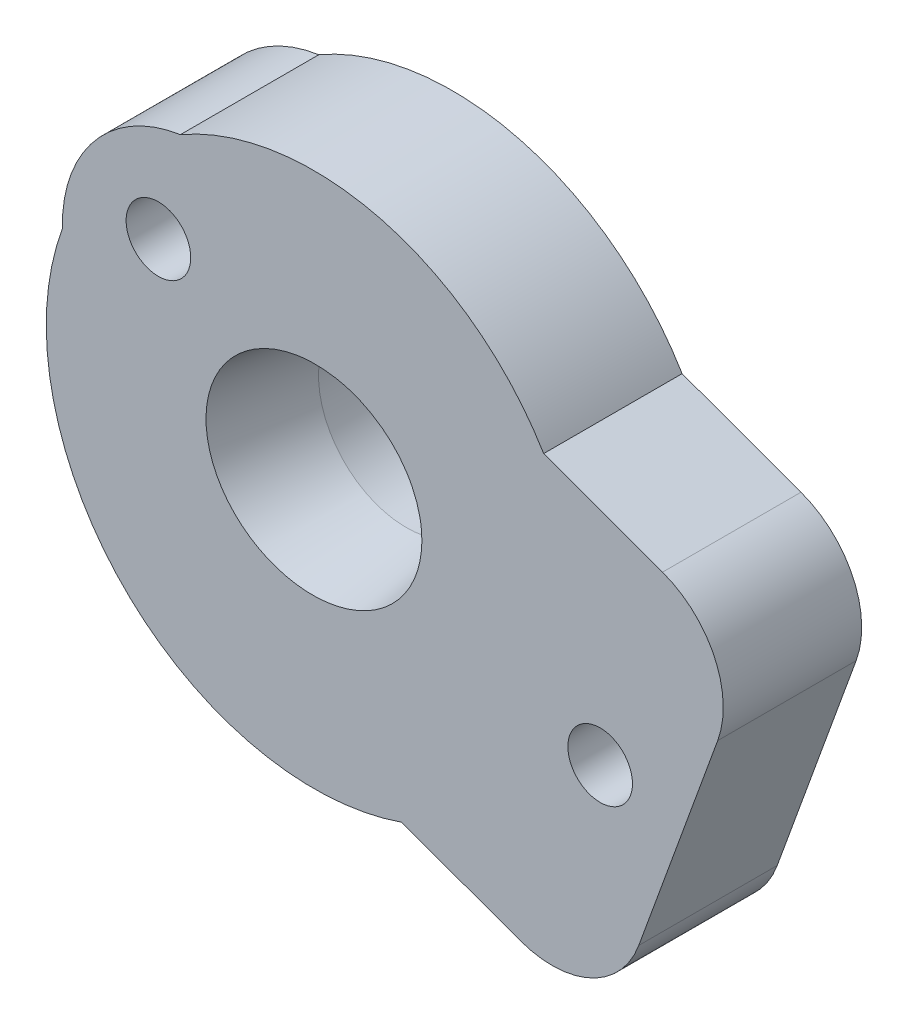
ISO-10303-21;
HEADER;
FILE_DESCRIPTION(('STEP AP214'),'2;1');
FILE_NAME('part.step','',(''),(''),'','','');
FILE_SCHEMA(('AUTOMOTIVE_DESIGN { 1 0 10303 214 1 1 1 1 }'));
ENDSEC;
DATA;
#1=APPLICATION_CONTEXT('core data for automotive mechanical design processes');
#2=APPLICATION_PROTOCOL_DEFINITION('international standard','automotive_design',2000,#1);
#3=PRODUCT_CONTEXT('',#1,'mechanical');
#4=PRODUCT('Part','Part','',(#3));
#5=PRODUCT_RELATED_PRODUCT_CATEGORY('part','',(#4));
#6=PRODUCT_DEFINITION_FORMATION('','',#4);
#7=PRODUCT_DEFINITION_CONTEXT('part definition',#1,'design');
#8=PRODUCT_DEFINITION('design','',#6,#7);
#9=PRODUCT_DEFINITION_SHAPE('','',#8);
#10=(LENGTH_UNIT() NAMED_UNIT(*) SI_UNIT(.MILLI.,.METRE.));
#11=(NAMED_UNIT(*) PLANE_ANGLE_UNIT() SI_UNIT($,.RADIAN.));
#12=(NAMED_UNIT(*) SI_UNIT($,.STERADIAN.) SOLID_ANGLE_UNIT());
#13=UNCERTAINTY_MEASURE_WITH_UNIT(LENGTH_MEASURE(1.E-05),#10,'distance_accuracy_value','');
#14=(GEOMETRIC_REPRESENTATION_CONTEXT(3) GLOBAL_UNCERTAINTY_ASSIGNED_CONTEXT((#13)) GLOBAL_UNIT_ASSIGNED_CONTEXT((#10,
#11,#12)) REPRESENTATION_CONTEXT('',''));
#15=CARTESIAN_POINT('',(0.,0.,0.));
#16=DIRECTION('',(0.,0.,1.));
#17=DIRECTION('',(1.,0.,0.));
#18=AXIS2_PLACEMENT_3D('',#15,#16,#17);
#19=CARTESIAN_POINT('',(0.,0.,10.));
#20=DIRECTION('',(0.,0.,-1.));
#21=DIRECTION('',(-1.,0.,0.));
#22=AXIS2_PLACEMENT_3D('',#19,#20,#21);
#23=CYLINDRICAL_SURFACE('',#22,29.);
#24=CARTESIAN_POINT('',(0.,0.,10.));
#25=DIRECTION('',(0.,0.,1.));
#26=DIRECTION('',(1.,0.,0.));
#27=AXIS2_PLACEMENT_3D('',#24,#25,#26);
#28=CIRCLE('',#27,29.);
#29=CARTESIAN_POINT('',(-27.2510860027963,9.91858415643088,10.));
#30=VERTEX_POINT('',#29);
#31=CARTESIAN_POINT('',(9.4973269071652,-27.4007441800115,10.));
#32=VERTEX_POINT('',#31);
#33=EDGE_CURVE('E156',#30,#32,#28,.T.);
#34=ORIENTED_EDGE('',*,*,#33,.F.);
#35=DIRECTION('',(0.,0.,1.));
#36=VECTOR('',#35,1.);
#37=CARTESIAN_POINT('',(-27.2510860027963,9.91858415643088,-5.));
#38=LINE('',#37,#36);
#39=CARTESIAN_POINT('',(-27.2510860027963,9.91858415643088,-5.));
#40=VERTEX_POINT('',#39);
#41=EDGE_CURVE('E214',#40,#30,#38,.T.);
#42=ORIENTED_EDGE('',*,*,#41,.F.);
#43=CARTESIAN_POINT('',(0.,0.,-5.));
#44=DIRECTION('',(0.,0.,1.));
#45=DIRECTION('',(1.,0.,0.));
#46=AXIS2_PLACEMENT_3D('',#43,#44,#45);
#47=CIRCLE('',#46,29.);
#48=CARTESIAN_POINT('',(9.4973269071652,-27.4007441800115,-5.));
#49=VERTEX_POINT('',#48);
#50=EDGE_CURVE('E225',#40,#49,#47,.T.);
#51=ORIENTED_EDGE('',*,*,#50,.T.);
#52=DIRECTION('',(0.,0.,-1.));
#53=VECTOR('',#52,1.);
#54=CARTESIAN_POINT('',(9.49732690716522,-27.4007441800115,10.));
#55=LINE('',#54,#53);
#56=EDGE_CURVE('E239',#49,#32,#55,.F.);
#57=ORIENTED_EDGE('',*,*,#56,.T.);
#58=EDGE_LOOP('',(#34,#42,#51,#57));
#59=FACE_BOUND('',#58,.T.);
#60=ADVANCED_FACE('F146',(#59),#23,.T.);
#61=CARTESIAN_POINT('',(24.88823335682,14.8854237553544,-5.));
#62=VERTEX_POINT('',#61);
#63=CARTESIAN_POINT('',(-14.4705437140708,25.1317202876995,-5.));
#64=VERTEX_POINT('',#63);
#65=EDGE_CURVE('E234',#62,#64,#47,.T.);
#66=ORIENTED_EDGE('',*,*,#65,.T.);
#67=DIRECTION('',(0.,0.,1.));
#68=VECTOR('',#67,1.);
#69=CARTESIAN_POINT('',(-14.4705437140708,25.1317202876995,-5.));
#70=LINE('',#69,#68);
#71=CARTESIAN_POINT('',(-14.4705437140708,25.1317202876995,10.));
#72=VERTEX_POINT('',#71);
#73=EDGE_CURVE('E217',#64,#72,#70,.T.);
#74=ORIENTED_EDGE('',*,*,#73,.T.);
#75=CARTESIAN_POINT('',(24.88823335682,14.8854237553545,10.));
#76=VERTEX_POINT('',#75);
#77=EDGE_CURVE('E13',#76,#72,#28,.T.);
#78=ORIENTED_EDGE('',*,*,#77,.F.);
#79=DIRECTION('',(0.,0.,-1.));
#80=VECTOR('',#79,1.);
#81=CARTESIAN_POINT('',(24.88823335682,14.8854237553544,10.));
#82=LINE('',#81,#80);
#83=EDGE_CURVE('E312',#62,#76,#82,.F.);
#84=ORIENTED_EDGE('',*,*,#83,.F.);
#85=EDGE_LOOP('',(#66,#74,#78,#84));
#86=FACE_BOUND('',#85,.T.);
#87=ADVANCED_FACE('F148',(#86),#23,.T.);
#88=CARTESIAN_POINT('',(0.,0.,10.));
#89=DIRECTION('',(0.,0.,1.));
#90=DIRECTION('',(1.,0.,0.));
#91=AXIS2_PLACEMENT_3D('',#88,#89,#90);
#92=PLANE('',#91);
#93=ORIENTED_EDGE('',*,*,#77,.T.);
#94=CARTESIAN_POINT('',(-12.2352670019781,10.2788370513048,10.));
#95=DIRECTION('',(0.,0.,1.));
#96=DIRECTION('',(1.,0.,0.));
#97=AXIS2_PLACEMENT_3D('',#94,#95,#96);
#98=CIRCLE('',#97,15.0201398932766);
#99=EDGE_CURVE('E163',#72,#30,#98,.T.);
#100=ORIENTED_EDGE('',*,*,#99,.T.);
#101=ORIENTED_EDGE('',*,*,#33,.T.);
#102=DIRECTION('',(-0.939692620785911,0.342020143325663,0.));
#103=VECTOR('',#102,1.);
#104=CARTESIAN_POINT('',(22.3747106403217,-32.0877285541042,10.));
#105=LINE('',#104,#103);
#106=CARTESIAN_POINT('',(22.3747106403217,-32.0877285541042,10.));
#107=VERTEX_POINT('',#106);
#108=EDGE_CURVE('E321',#107,#32,#105,.T.);
#109=ORIENTED_EDGE('',*,*,#108,.F.);
#110=CARTESIAN_POINT('',(25.7949120735784,-22.6908023462451,10.));
#111=DIRECTION('',(0.,0.,1.));
#112=DIRECTION('',(1.,0.,0.));
#113=AXIS2_PLACEMENT_3D('',#110,#111,#112);
#114=CIRCLE('',#113,10.);
#115=CARTESIAN_POINT('',(35.1918382814375,-26.1110037795017,10.));
#116=VERTEX_POINT('',#115);
#117=EDGE_CURVE('E324',#116,#107,#114,.F.);
#118=ORIENTED_EDGE('',*,*,#117,.F.);
#119=DIRECTION('',(0.342020143325663,0.939692620785911,0.));
#120=VECTOR('',#119,1.);
#121=CARTESIAN_POINT('',(35.1918382814375,-26.1110037795017,10.));
#122=LINE('',#121,#120);
#123=CARTESIAN_POINT('',(43.742341864579,-2.61868825985399,10.));
#124=VERTEX_POINT('',#123);
#125=EDGE_CURVE('E329',#116,#124,#122,.T.);
#126=ORIENTED_EDGE('',*,*,#125,.T.);
#127=CARTESIAN_POINT('',(34.3454156567199,0.80151317340266,10.));
#128=DIRECTION('',(0.,0.,1.));
#129=DIRECTION('',(1.,0.,0.));
#130=AXIS2_PLACEMENT_3D('',#127,#128,#129);
#131=CIRCLE('',#130,10.);
#132=CARTESIAN_POINT('',(37.7656170899766,10.1984393812618,10.));
#133=VERTEX_POINT('',#132);
#134=EDGE_CURVE('E315',#124,#133,#131,.T.);
#135=ORIENTED_EDGE('',*,*,#134,.T.);
#136=DIRECTION('',(-0.939692620785911,0.342020143325663,0.));
#137=VECTOR('',#136,1.);
#138=CARTESIAN_POINT('',(37.7656170899766,10.1984393812618,10.));
#139=LINE('',#138,#137);
#140=EDGE_CURVE('E169',#133,#76,#139,.T.);
#141=ORIENTED_EDGE('',*,*,#140,.T.);
#142=EDGE_LOOP('',(#93,#100,#101,#109,#118,#126,#135,#141));
#143=FACE_BOUND('',#142,.T.);
#144=CARTESIAN_POINT('',(-16.8529777486086,14.1413274131145,10.));
#145=DIRECTION('',(0.,0.,1.));
#146=DIRECTION('',(1.,0.,0.));
#147=AXIS2_PLACEMENT_3D('',#144,#145,#146);
#148=CIRCLE('',#147,3.5);
#149=CARTESIAN_POINT('',(-13.3529777486086,14.1413274131145,10.));
#150=VERTEX_POINT('',#149);
#151=EDGE_CURVE('E325',#150,#150,#148,.T.);
#152=ORIENTED_EDGE('',*,*,#151,.F.);
#153=EDGE_LOOP('',(#152));
#154=FACE_BOUND('',#153,.T.);
#155=CARTESIAN_POINT('',(0.,0.,10.));
#156=DIRECTION('',(0.,0.,1.));
#157=DIRECTION('',(0.996194698091745,0.0871557427476656,0.));
#158=AXIS2_PLACEMENT_3D('',#155,#156,#157);
#159=ELLIPSE('',#158,11.7,10.9);
#160=CARTESIAN_POINT('',(11.6554779676734,1.01972219014769,10.));
#161=VERTEX_POINT('',#160);
#162=EDGE_CURVE('E298',#161,#161,#159,.T.);
#163=ORIENTED_EDGE('',*,*,#162,.F.);
#164=EDGE_LOOP('',(#163));
#165=FACE_BOUND('',#164,.T.);
#166=CARTESIAN_POINT('',(31.009856485935,-11.2866647297469,10.));
#167=DIRECTION('',(0.,0.,1.));
#168=DIRECTION('',(1.,0.,0.));
#169=AXIS2_PLACEMENT_3D('',#166,#167,#168);
#170=CIRCLE('',#169,3.5);
#171=CARTESIAN_POINT('',(34.509856485935,-11.2866647297469,10.));
#172=VERTEX_POINT('',#171);
#173=EDGE_CURVE('E310',#172,#172,#170,.F.);
#174=ORIENTED_EDGE('',*,*,#173,.T.);
#175=EDGE_LOOP('',(#174));
#176=FACE_BOUND('',#175,.T.);
#177=ADVANCED_FACE('F275',(#143,#154,#165,#176),#92,.T.);
#178=CARTESIAN_POINT('',(0.82797955610265,-9.4638496318716,0.));
#179=CARTESIAN_POINT('',(0.848315896077142,-9.69629506142633,1.66666666666667));
#180=CARTESIAN_POINT('',(0.888988576026125,-10.1611859205358,5.));
#181=CARTESIAN_POINT('',(0.929661255975078,-10.6260767796453,8.33333333333334));
#182=CARTESIAN_POINT('',(0.949997595949554,-10.8585222092,10.));
#183=CARTESIAN_POINT('',(2.0667945661406,-9.35546736228754,0.));
#184=CARTESIAN_POINT('',(2.12792208834004,-9.58434402582576,1.66666666666667));
#185=CARTESIAN_POINT('',(2.25017713273893,-10.0420973529022,5.));
#186=CARTESIAN_POINT('',(2.36605710040764,-10.5004084269217,8.33333333333334));
#187=CARTESIAN_POINT('',(2.42399708424199,-10.7295639639314,10.));
#188=CARTESIAN_POINT('',(4.50089888047922,-8.64656557606986,0.));
#189=CARTESIAN_POINT('',(4.64350675930876,-8.86484387485121,1.66666666666666));
#190=CARTESIAN_POINT('',(4.92872251696785,-9.30140047241392,4.99999999999999));
#191=CARTESIAN_POINT('',(5.1939292748559,-9.73251379813695,8.33333333333334));
#192=CARTESIAN_POINT('',(5.32653265379993,-9.94807046099846,10.));
#193=CARTESIAN_POINT('',(7.46716345646486,-6.26550092433688,0.));
#194=CARTESIAN_POINT('',(7.73507009998541,-6.44343938202825,1.66666666666667));
#195=CARTESIAN_POINT('',(8.27088338702653,-6.79931629741098,5.00000000000002));
#196=CARTESIAN_POINT('',(8.7501401870744,-7.1369514054178,8.33333333333333));
#197=CARTESIAN_POINT('',(8.98976858709834,-7.30576895942121,9.99999999999998));
#198=CARTESIAN_POINT('',(9.29650319896245,-2.93123231543229,0.));
#199=CARTESIAN_POINT('',(9.66743128755973,-3.02182287384426,1.66666666666666));
#200=CARTESIAN_POINT('',(10.4092874647543,-3.20300399066821,4.99999999999999));
#201=CARTESIAN_POINT('',(11.0589275568529,-3.37289987928917,8.33333333333333));
#202=CARTESIAN_POINT('',(11.3837476029022,-3.45784782359964,10.));
#203=CARTESIAN_POINT('',(9.71057118739856,0.849564895258722,0.));
#204=CARTESIAN_POINT('',(10.1158578897645,0.885022887193555,1.66666666666667));
#205=CARTESIAN_POINT('',(10.9264312944965,0.95593887106322,5.00000000000001));
#206=CARTESIAN_POINT('',(11.6328464496746,1.01774218888427,8.33333333333334));
#207=CARTESIAN_POINT('',(11.9860540272637,1.0486438477948,10.));
#208=CARTESIAN_POINT('',(8.64626527634788,4.50102114929213,0.));
#209=CARTESIAN_POINT('',(8.9958272484264,4.65464642019637,1.66666666666666));
#210=CARTESIAN_POINT('',(9.69495119258344,4.96189696200486,4.99999999999999));
#211=CARTESIAN_POINT('',(10.3052196804976,5.24202056845598,8.33333333333333));
#212=CARTESIAN_POINT('',(10.6103539244546,5.38208237168153,10.));
#213=CARTESIAN_POINT('',(6.26572764725463,7.46697321334815,0.));
#214=CARTESIAN_POINT('',(6.49866549796217,7.68872988647386,1.66666666666667));
#215=CARTESIAN_POINT('',(6.96454119937725,8.13224323272529,5.00000000000002));
#216=CARTESIAN_POINT('',(7.37788729052637,8.54797097474241,8.33333333333332));
#217=CARTESIAN_POINT('',(7.58456033610093,8.75583484575096,9.99999999999997));
#218=CARTESIAN_POINT('',(2.93105975765796,9.29677770470038,0.));
#219=CARTESIAN_POINT('',(3.03359747356226,9.53650346393429,1.66666666666666));
#220=CARTESIAN_POINT('',(3.23867290537087,10.0159549824021,4.99999999999999));
#221=CARTESIAN_POINT('',(3.42498853331052,10.4865713982132,8.33333333333334));
#222=CARTESIAN_POINT('',(3.51814634728035,10.7218796061188,10.));
#223=CARTESIAN_POINT('',(0.410835453935297,9.57223190145566,0.));
#224=CARTESIAN_POINT('',(0.4312902961858,9.8082460970269,1.66666666666667));
#225=CARTESIAN_POINT('',(0.472199980686806,10.2802744881694,5.));
#226=CARTESIAN_POINT('',(0.506734588457658,10.7517451323689,8.33333333333334));
#227=CARTESIAN_POINT('',(0.524001892343083,10.9874804544686,10.));
#228=CARTESIAN_POINT('',(-2.06679456614061,9.35546736228753,0.));
#229=CARTESIAN_POINT('',(-2.12792208834001,9.58434402582577,1.66666666666667));
#230=CARTESIAN_POINT('',(-2.25017713273881,10.0420973529022,5.));
#231=CARTESIAN_POINT('',(-2.36605710040748,10.5004084269217,8.33333333333333));
#232=CARTESIAN_POINT('',(-2.42399708424181,10.7295639639314,10.));
#233=CARTESIAN_POINT('',(-4.50089888047922,8.64656557606986,0.));
#234=CARTESIAN_POINT('',(-4.64350675930873,8.86484387485123,1.66666666666667));
#235=CARTESIAN_POINT('',(-4.92872251696775,9.30140047241397,5.));
#236=CARTESIAN_POINT('',(-5.19392927485576,9.73251379813701,8.33333333333331));
#237=CARTESIAN_POINT('',(-5.32653265379977,9.94807046099852,9.99999999999997));
#238=CARTESIAN_POINT('',(-7.46716345646489,6.26550092433686,0.));
#239=CARTESIAN_POINT('',(-7.73507009998542,6.44343938202825,1.66666666666667));
#240=CARTESIAN_POINT('',(-8.27088338702649,6.79931629741101,5.00000000000001));
#241=CARTESIAN_POINT('',(-8.75014018707435,7.13695140541789,8.33333333333335));
#242=CARTESIAN_POINT('',(-8.98976858709828,7.30576895942132,10.));
#243=CARTESIAN_POINT('',(-9.29650319896246,2.93123231543228,0.));
#244=CARTESIAN_POINT('',(-9.66743128755973,3.02182287384428,1.66666666666667));
#245=CARTESIAN_POINT('',(-10.4092874647543,3.20300399066826,5.));
#246=CARTESIAN_POINT('',(-11.0589275568529,3.37289987928922,8.33333333333331));
#247=CARTESIAN_POINT('',(-11.3837476029022,3.45784782359969,9.99999999999997));
#248=CARTESIAN_POINT('',(-9.71057118739855,-0.849564895258744,0.));
#249=CARTESIAN_POINT('',(-10.1158578897645,-0.885022887193575,1.66666666666667));
#250=CARTESIAN_POINT('',(-10.9264312944965,-0.955938871063238,5.00000000000001));
#251=CARTESIAN_POINT('',(-11.6328464496746,-1.01774218888426,8.33333333333336));
#252=CARTESIAN_POINT('',(-11.9860540272637,-1.04864384779477,10.));
#253=CARTESIAN_POINT('',(-8.64626527634789,-4.50102114929208,0.));
#254=CARTESIAN_POINT('',(-8.99582724842641,-4.65464642019636,1.66666666666666));
#255=CARTESIAN_POINT('',(-9.69495119258344,-4.96189696200491,4.99999999999998));
#256=CARTESIAN_POINT('',(-10.3052196804975,-5.24202056845605,8.33333333333333));
#257=CARTESIAN_POINT('',(-10.6103539244546,-5.38208237168161,9.99999999999999));
#258=CARTESIAN_POINT('',(-6.26572764725465,-7.46697321334818,0.));
#259=CARTESIAN_POINT('',(-6.49866549796215,-7.68872988647389,1.66666666666667));
#260=CARTESIAN_POINT('',(-6.96454119937714,-8.13224323272532,5.00000000000002));
#261=CARTESIAN_POINT('',(-7.37788729052629,-8.54797097474247,8.33333333333334));
#262=CARTESIAN_POINT('',(-7.58456033610087,-8.75583484575104,9.99999999999999));
#263=CARTESIAN_POINT('',(-2.93105975765798,-9.29677770470035,0.));
#264=CARTESIAN_POINT('',(-3.03359747356226,-9.53650346393428,1.66666666666667));
#265=CARTESIAN_POINT('',(-3.23867290537083,-10.0159549824021,5.));
#266=CARTESIAN_POINT('',(-3.42498853331037,-10.4865713982133,8.33333333333333));
#267=CARTESIAN_POINT('',(-3.51814634728015,-10.7218796061188,10.));
#268=CARTESIAN_POINT('',(-0.410835453935306,-9.57223190145566,0.));
#269=CARTESIAN_POINT('',(-0.431290296185767,-9.8082460970269,1.66666666666667));
#270=CARTESIAN_POINT('',(-0.472199980686687,-10.2802744881694,5.));
#271=CARTESIAN_POINT('',(-0.506734588457493,-10.7517451323689,8.33333333333334));
#272=CARTESIAN_POINT('',(-0.524001892342896,-10.9874804544686,10.));
#273=CARTESIAN_POINT('',(0.82797955610265,-9.4638496318716,0.));
#274=CARTESIAN_POINT('',(0.848315896077142,-9.69629506142633,1.66666666666667));
#275=CARTESIAN_POINT('',(0.888988576026125,-10.1611859205358,5.));
#276=CARTESIAN_POINT('',(0.929661255975078,-10.6260767796453,8.33333333333334));
#277=CARTESIAN_POINT('',(0.949997595949554,-10.8585222092,10.));
#278=B_SPLINE_SURFACE_WITH_KNOTS('',3,3,((#178,#179,#180,#181,#182),(#183,#184,#185,#186,#187),
(#188,#189,#190,#191,#192),(#193,#194,#195,#196,#197),(#198,#199,#200,#201,#202),(#203,#204,
#205,#206,#207),(#208,#209,#210,#211,#212),(#213,#214,#215,#216,#217),(#218,#219,#220,#221,
#222),(#223,#224,#225,#226,#227),(#228,#229,#230,#231,#232),(#233,#234,#235,#236,#237),(#238,
#239,#240,#241,#242),(#243,#244,#245,#246,#247),(#248,#249,#250,#251,#252),(#253,#254,#255,#256,
#257),(#258,#259,#260,#261,#262),(#263,#264,#265,#266,#267),(#268,#269,#270,#271,#272),(#273,
#274,#275,#276,#277)),.UNSPECIFIED.,.T.,.F.,.F.,(4,1,1,1,1,1,1,1,2,1,1,1,1,1,1,1,4),(4,1,4),(0.,
0.0624999999999998,0.125,0.1875,0.249999999999999,0.312499999999999,0.374999999999999,
0.437499999999999,0.499999999999999,0.562499999999999,0.624999999999999,0.687499999999999,
0.749999999999999,0.8125,0.875,0.9375,1.),(0.,0.5,1.),.UNSPECIFIED.);
#279=CARTESIAN_POINT('',(0.,0.,0.));
#280=DIRECTION('',(0.,0.,1.));
#281=DIRECTION('',(0.996194698091745,0.0871557427476652,0.));
#282=AXIS2_PLACEMENT_3D('',#279,#280,#281);
#283=ELLIPSE('',#282,9.50000000000001,9.50000000000001);
#284=CARTESIAN_POINT('',(9.46384963187158,0.82797955610282,0.));
#285=VERTEX_POINT('',#284);
#286=EDGE_CURVE('E237',#285,#285,#283,.T.);
#287=ORIENTED_EDGE('',*,*,#286,.F.);
#288=EDGE_LOOP('',(#287));
#289=FACE_BOUND('',#288,.T.);
#290=ORIENTED_EDGE('',*,*,#162,.T.);
#291=EDGE_LOOP('',(#290));
#292=FACE_BOUND('',#291,.T.);
#293=ADVANCED_FACE('F269',(#289,#292),#278,.F.);
#294=CARTESIAN_POINT('',(0.,0.,-5.));
#295=DIRECTION('',(0.,0.,1.));
#296=DIRECTION('',(1.,0.,0.));
#297=AXIS2_PLACEMENT_3D('',#294,#295,#296);
#298=PLANE('',#297);
#299=CARTESIAN_POINT('',(-16.8529777486086,14.1413274131145,-5.));
#300=DIRECTION('',(0.,0.,-1.));
#301=DIRECTION('',(-1.,0.,0.));
#302=AXIS2_PLACEMENT_3D('',#299,#300,#301);
#303=CIRCLE('',#302,3.5);
#304=CARTESIAN_POINT('',(-20.3529777486086,14.1413274131145,-5.));
#305=VERTEX_POINT('',#304);
#306=EDGE_CURVE('E367',#305,#305,#303,.T.);
#307=ORIENTED_EDGE('',*,*,#306,.F.);
#308=EDGE_LOOP('',(#307));
#309=FACE_BOUND('',#308,.T.);
#310=ORIENTED_EDGE('',*,*,#50,.F.);
#311=CARTESIAN_POINT('',(-12.2352670019781,10.2788370513048,-5.));
#312=DIRECTION('',(0.,0.,1.));
#313=DIRECTION('',(1.,0.,0.));
#314=AXIS2_PLACEMENT_3D('',#311,#312,#313);
#315=CIRCLE('',#314,15.0201398932766);
#316=EDGE_CURVE('E211',#64,#40,#315,.T.);
#317=ORIENTED_EDGE('',*,*,#316,.F.);
#318=ORIENTED_EDGE('',*,*,#65,.F.);
#319=DIRECTION('',(-0.93969262078591,0.342020143325663,0.));
#320=VECTOR('',#319,1.);
#321=CARTESIAN_POINT('',(37.7656170899766,10.1984393812618,-5.));
#322=LINE('',#321,#320);
#323=CARTESIAN_POINT('',(37.7656170899766,10.1984393812618,-5.));
#324=VERTEX_POINT('',#323);
#325=EDGE_CURVE('E341',#324,#62,#322,.T.);
#326=ORIENTED_EDGE('',*,*,#325,.F.);
#327=CARTESIAN_POINT('',(34.3454156567199,0.80151317340266,-5.));
#328=DIRECTION('',(0.,0.,1.));
#329=DIRECTION('',(1.,0.,0.));
#330=AXIS2_PLACEMENT_3D('',#327,#328,#329);
#331=CIRCLE('',#330,10.);
#332=CARTESIAN_POINT('',(43.742341864579,-2.61868825985399,-5.));
#333=VERTEX_POINT('',#332);
#334=EDGE_CURVE('E339',#333,#324,#331,.T.);
#335=ORIENTED_EDGE('',*,*,#334,.F.);
#336=DIRECTION('',(0.342020143325663,0.939692620785911,0.));
#337=VECTOR('',#336,1.);
#338=CARTESIAN_POINT('',(35.1918382814375,-26.1110037795017,-5.));
#339=LINE('',#338,#337);
#340=CARTESIAN_POINT('',(35.1918382814375,-26.1110037795017,-5.));
#341=VERTEX_POINT('',#340);
#342=EDGE_CURVE('E336',#341,#333,#339,.T.);
#343=ORIENTED_EDGE('',*,*,#342,.F.);
#344=CARTESIAN_POINT('',(25.7949120735784,-22.6908023462451,-5.));
#345=DIRECTION('',(0.,0.,-1.));
#346=DIRECTION('',(-1.,0.,0.));
#347=AXIS2_PLACEMENT_3D('',#344,#345,#346);
#348=CIRCLE('',#347,10.);
#349=CARTESIAN_POINT('',(22.3747106403217,-32.0877285541042,-5.));
#350=VERTEX_POINT('',#349);
#351=EDGE_CURVE('E331',#341,#350,#348,.T.);
#352=ORIENTED_EDGE('',*,*,#351,.T.);
#353=DIRECTION('',(-0.939692620785911,0.342020143325663,0.));
#354=VECTOR('',#353,1.);
#355=CARTESIAN_POINT('',(22.3747106403217,-32.0877285541042,-5.));
#356=LINE('',#355,#354);
#357=EDGE_CURVE('E233',#350,#49,#356,.T.);
#358=ORIENTED_EDGE('',*,*,#357,.T.);
#359=EDGE_LOOP('',(#310,#317,#318,#326,#335,#343,#352,#358));
#360=FACE_BOUND('',#359,.T.);
#361=CARTESIAN_POINT('',(0.,0.,-5.));
#362=DIRECTION('',(0.,0.,1.));
#363=DIRECTION('',(0.996194698091745,0.0871557427476652,0.));
#364=AXIS2_PLACEMENT_3D('',#361,#362,#363);
#365=ELLIPSE('',#364,9.50000000000001,9.50000000000001);
#366=CARTESIAN_POINT('',(9.46384963187158,0.82797955610282,-5.));
#367=VERTEX_POINT('',#366);
#368=EDGE_CURVE('E235',#367,#367,#365,.T.);
#369=ORIENTED_EDGE('',*,*,#368,.T.);
#370=EDGE_LOOP('',(#369));
#371=FACE_BOUND('',#370,.T.);
#372=CARTESIAN_POINT('',(31.009856485935,-11.2866647297469,-5.));
#373=DIRECTION('',(0.,0.,-1.));
#374=DIRECTION('',(-1.,0.,0.));
#375=AXIS2_PLACEMENT_3D('',#372,#373,#374);
#376=CIRCLE('',#375,3.5);
#377=CARTESIAN_POINT('',(27.509856485935,-11.2866647297469,-5.));
#378=VERTEX_POINT('',#377);
#379=EDGE_CURVE('E319',#378,#378,#376,.T.);
#380=ORIENTED_EDGE('',*,*,#379,.F.);
#381=EDGE_LOOP('',(#380));
#382=FACE_BOUND('',#381,.T.);
#383=ADVANCED_FACE('F229',(#309,#360,#371,#382),#298,.F.);
#384=DIRECTION('',(0.,0.,1.));
#385=VECTOR('',#384,1.);
#386=SURFACE_OF_LINEAR_EXTRUSION('',#365,#385);
#387=ORIENTED_EDGE('',*,*,#368,.F.);
#388=EDGE_LOOP('',(#387));
#389=FACE_BOUND('',#388,.T.);
#390=ORIENTED_EDGE('',*,*,#286,.T.);
#391=EDGE_LOOP('',(#390));
#392=FACE_BOUND('',#391,.T.);
#393=ADVANCED_FACE('F253',(#389,#392),#386,.F.);
#394=CARTESIAN_POINT('',(22.3747106403217,-32.0877285541042,69.0388031764485));
#395=DIRECTION('',(-0.342020143325663,-0.93969262078591,0.));
#396=DIRECTION('',(0.939692620785911,-0.342020143325663,0.));
#397=AXIS2_PLACEMENT_3D('',#394,#395,#396);
#398=PLANE('',#397);
#399=ORIENTED_EDGE('',*,*,#56,.F.);
#400=ORIENTED_EDGE('',*,*,#357,.F.);
#401=DIRECTION('',(0.,0.,-1.));
#402=VECTOR('',#401,1.);
#403=CARTESIAN_POINT('',(22.3747106403217,-32.0877285541042,69.0388031764485));
#404=LINE('',#403,#402);
#405=EDGE_CURVE('E328',#107,#350,#404,.T.);
#406=ORIENTED_EDGE('',*,*,#405,.F.);
#407=ORIENTED_EDGE('',*,*,#108,.T.);
#408=EDGE_LOOP('',(#399,#400,#406,#407));
#409=FACE_BOUND('',#408,.T.);
#410=ADVANCED_FACE('F263',(#409),#398,.T.);
#411=CARTESIAN_POINT('',(37.7656170899766,10.1984393812618,69.0388031764485));
#412=DIRECTION('',(-0.342020143325663,-0.93969262078591,0.));
#413=DIRECTION('',(0.939692620785911,-0.342020143325663,0.));
#414=AXIS2_PLACEMENT_3D('',#411,#412,#413);
#415=PLANE('',#414);
#416=ORIENTED_EDGE('',*,*,#325,.T.);
#417=ORIENTED_EDGE('',*,*,#83,.T.);
#418=ORIENTED_EDGE('',*,*,#140,.F.);
#419=DIRECTION('',(0.,0.,-1.));
#420=VECTOR('',#419,1.);
#421=CARTESIAN_POINT('',(37.7656170899766,10.1984393812618,69.0388031764485));
#422=LINE('',#421,#420);
#423=EDGE_CURVE('E340',#133,#324,#422,.T.);
#424=ORIENTED_EDGE('',*,*,#423,.T.);
#425=EDGE_LOOP('',(#416,#417,#418,#424));
#426=FACE_BOUND('',#425,.T.);
#427=ADVANCED_FACE('F363',(#426),#415,.F.);
#428=CARTESIAN_POINT('',(25.7949120735784,-22.6908023462451,69.0388031764485));
#429=DIRECTION('',(0.,0.,-1.));
#430=DIRECTION('',(-1.,0.,0.));
#431=AXIS2_PLACEMENT_3D('',#428,#429,#430);
#432=CYLINDRICAL_SURFACE('',#431,10.);
#433=DIRECTION('',(0.,0.,-1.));
#434=VECTOR('',#433,1.);
#435=CARTESIAN_POINT('',(35.1918382814375,-26.1110037795017,69.0388031764485));
#436=LINE('',#435,#434);
#437=EDGE_CURVE('E334',#116,#341,#436,.T.);
#438=ORIENTED_EDGE('',*,*,#437,.F.);
#439=ORIENTED_EDGE('',*,*,#117,.T.);
#440=ORIENTED_EDGE('',*,*,#405,.T.);
#441=ORIENTED_EDGE('',*,*,#351,.F.);
#442=EDGE_LOOP('',(#438,#439,#440,#441));
#443=FACE_BOUND('',#442,.T.);
#444=ADVANCED_FACE('F350',(#443),#432,.T.);
#445=CARTESIAN_POINT('',(35.1918382814375,-26.1110037795017,69.0388031764485));
#446=DIRECTION('',(-0.939692620785911,0.342020143325663,0.));
#447=DIRECTION('',(-0.342020143325663,-0.939692620785911,0.));
#448=AXIS2_PLACEMENT_3D('',#445,#446,#447);
#449=PLANE('',#448);
#450=ORIENTED_EDGE('',*,*,#125,.F.);
#451=ORIENTED_EDGE('',*,*,#437,.T.);
#452=ORIENTED_EDGE('',*,*,#342,.T.);
#453=DIRECTION('',(0.,0.,-1.));
#454=VECTOR('',#453,1.);
#455=CARTESIAN_POINT('',(43.742341864579,-2.61868825985399,69.0388031764485));
#456=LINE('',#455,#454);
#457=EDGE_CURVE('E337',#124,#333,#456,.T.);
#458=ORIENTED_EDGE('',*,*,#457,.F.);
#459=EDGE_LOOP('',(#450,#451,#452,#458));
#460=FACE_BOUND('',#459,.T.);
#461=ADVANCED_FACE('F354',(#460),#449,.F.);
#462=CARTESIAN_POINT('',(34.3454156567199,0.80151317340266,69.0388031764485));
#463=DIRECTION('',(0.,0.,-1.));
#464=DIRECTION('',(-1.,0.,0.));
#465=AXIS2_PLACEMENT_3D('',#462,#463,#464);
#466=CYLINDRICAL_SURFACE('',#465,10.);
#467=ORIENTED_EDGE('',*,*,#134,.F.);
#468=ORIENTED_EDGE('',*,*,#457,.T.);
#469=ORIENTED_EDGE('',*,*,#334,.T.);
#470=ORIENTED_EDGE('',*,*,#423,.F.);
#471=EDGE_LOOP('',(#467,#468,#469,#470));
#472=FACE_BOUND('',#471,.T.);
#473=ADVANCED_FACE('F360',(#472),#466,.T.);
#474=CARTESIAN_POINT('',(31.009856485935,-11.2866647297469,69.0388031764485));
#475=DIRECTION('',(0.,0.,-1.));
#476=DIRECTION('',(-1.,0.,0.));
#477=AXIS2_PLACEMENT_3D('',#474,#475,#476);
#478=CYLINDRICAL_SURFACE('',#477,3.5);
#479=ORIENTED_EDGE('',*,*,#379,.T.);
#480=EDGE_LOOP('',(#479));
#481=FACE_BOUND('',#480,.T.);
#482=ORIENTED_EDGE('',*,*,#173,.F.);
#483=EDGE_LOOP('',(#482));
#484=FACE_BOUND('',#483,.T.);
#485=ADVANCED_FACE('F265',(#481,#484),#478,.F.);
#486=CARTESIAN_POINT('',(-16.8529777486086,14.1413274131145,10.0113971829949));
#487=DIRECTION('',(0.,0.,-1.));
#488=DIRECTION('',(-1.,0.,0.));
#489=AXIS2_PLACEMENT_3D('',#486,#487,#488);
#490=CYLINDRICAL_SURFACE('',#489,3.5);
#491=ORIENTED_EDGE('',*,*,#151,.T.);
#492=EDGE_LOOP('',(#491));
#493=FACE_BOUND('',#492,.T.);
#494=ORIENTED_EDGE('',*,*,#306,.T.);
#495=EDGE_LOOP('',(#494));
#496=FACE_BOUND('',#495,.T.);
#497=ADVANCED_FACE('F383',(#493,#496),#490,.F.);
#498=CARTESIAN_POINT('',(-12.2352670019781,10.2788370513048,-5.));
#499=DIRECTION('',(0.,0.,1.));
#500=DIRECTION('',(1.,0.,0.));
#501=AXIS2_PLACEMENT_3D('',#498,#499,#500);
#502=CYLINDRICAL_SURFACE('',#501,15.0201398932766);
#503=ORIENTED_EDGE('',*,*,#99,.F.);
#504=ORIENTED_EDGE('',*,*,#73,.F.);
#505=ORIENTED_EDGE('',*,*,#316,.T.);
#506=ORIENTED_EDGE('',*,*,#41,.T.);
#507=EDGE_LOOP('',(#503,#504,#505,#506));
#508=FACE_BOUND('',#507,.T.);
#509=ADVANCED_FACE('F213',(#508),#502,.T.);
#510=CLOSED_SHELL('',(#60,#87,#177,#293,#383,#393,#410,#427,#444,#461,#473,#485,#497,#509));
#511=MANIFOLD_SOLID_BREP('B2',#510);
#512=ADVANCED_BREP_SHAPE_REPRESENTATION('',(#18,#511),#14);
#513=SHAPE_DEFINITION_REPRESENTATION(#9,#512);
ENDSEC;
END-ISO-10303-21;
